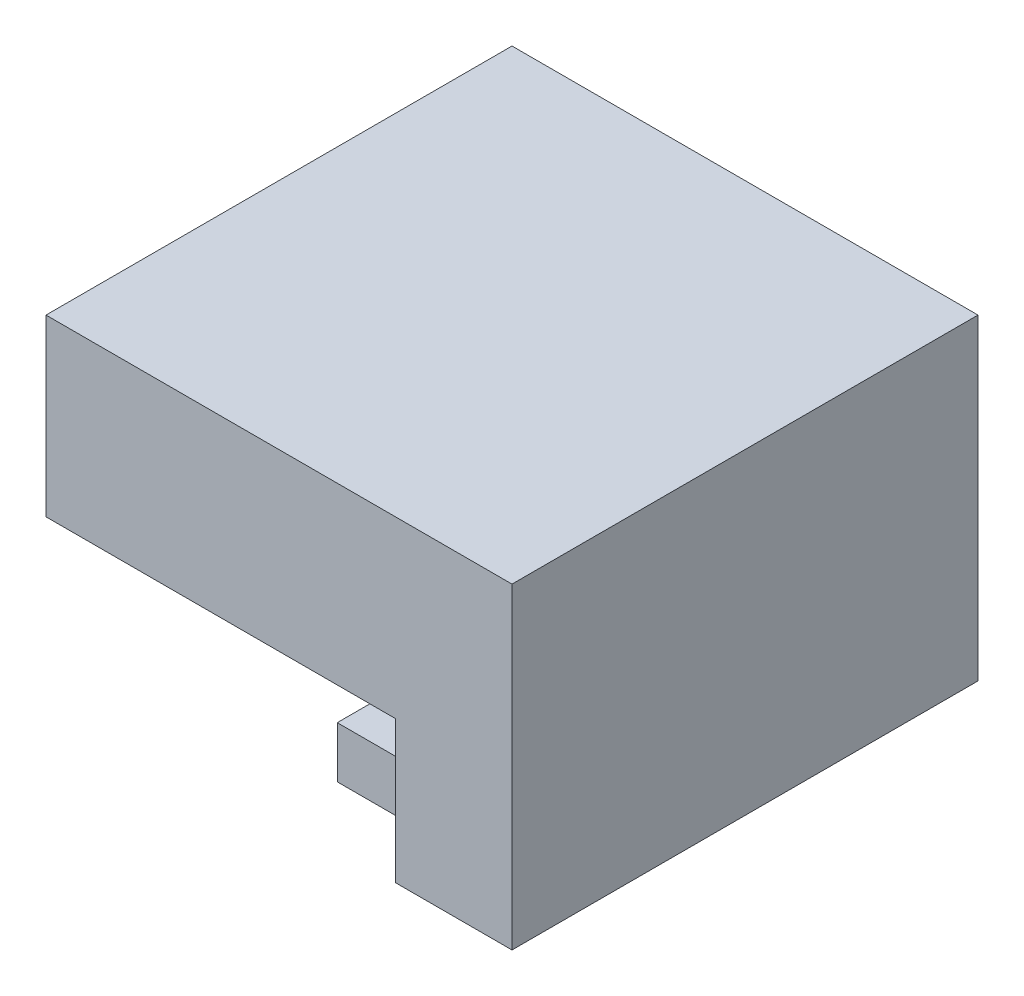
ISO-10303-21;
HEADER;
FILE_DESCRIPTION(('STEP AP214'),'2;1');
FILE_NAME('part.step','',(''),(''),'','','');
FILE_SCHEMA(('AUTOMOTIVE_DESIGN { 1 0 10303 214 1 1 1 1 }'));
ENDSEC;
DATA;
#1=APPLICATION_CONTEXT('core data for automotive mechanical design processes');
#2=APPLICATION_PROTOCOL_DEFINITION('international standard','automotive_design',2000,#1);
#3=PRODUCT_CONTEXT('',#1,'mechanical');
#4=PRODUCT('Part','Part','',(#3));
#5=PRODUCT_RELATED_PRODUCT_CATEGORY('part','',(#4));
#6=PRODUCT_DEFINITION_FORMATION('','',#4);
#7=PRODUCT_DEFINITION_CONTEXT('part definition',#1,'design');
#8=PRODUCT_DEFINITION('design','',#6,#7);
#9=PRODUCT_DEFINITION_SHAPE('','',#8);
#10=(LENGTH_UNIT() NAMED_UNIT(*) SI_UNIT(.MILLI.,.METRE.));
#11=(NAMED_UNIT(*) PLANE_ANGLE_UNIT() SI_UNIT($,.RADIAN.));
#12=(NAMED_UNIT(*) SI_UNIT($,.STERADIAN.) SOLID_ANGLE_UNIT());
#13=UNCERTAINTY_MEASURE_WITH_UNIT(LENGTH_MEASURE(1.E-05),#10,'distance_accuracy_value','');
#14=(GEOMETRIC_REPRESENTATION_CONTEXT(3) GLOBAL_UNCERTAINTY_ASSIGNED_CONTEXT((#13)) GLOBAL_UNIT_ASSIGNED_CONTEXT((#10,
#11,#12)) REPRESENTATION_CONTEXT('',''));
#15=CARTESIAN_POINT('',(0.,0.,0.));
#16=DIRECTION('',(0.,0.,1.));
#17=DIRECTION('',(1.,0.,0.));
#18=AXIS2_PLACEMENT_3D('',#15,#16,#17);
#19=CARTESIAN_POINT('',(19.05,-12.5095,12.7));
#20=DIRECTION('',(1.,0.,0.));
#21=DIRECTION('',(0.,0.,-1.));
#22=AXIS2_PLACEMENT_3D('',#19,#20,#21);
#23=PLANE('',#22);
#24=DIRECTION('',(0.,-1.,0.));
#25=VECTOR('',#24,1.);
#26=CARTESIAN_POINT('',(19.05,-12.5095,-9.525));
#27=LINE('',#26,#25);
#28=CARTESIAN_POINT('',(19.05,-9.7155,-9.525));
#29=VERTEX_POINT('',#28);
#30=CARTESIAN_POINT('',(19.05,-12.5095,-9.525));
#31=VERTEX_POINT('',#30);
#32=EDGE_CURVE('E58',#29,#31,#27,.T.);
#33=ORIENTED_EDGE('',*,*,#32,.F.);
#34=DIRECTION('',(0.,0.,-1.));
#35=VECTOR('',#34,1.);
#36=CARTESIAN_POINT('',(19.05,-9.7155,-9.525));
#37=LINE('',#36,#35);
#38=CARTESIAN_POINT('',(19.05,-9.7155,9.525));
#39=VERTEX_POINT('',#38);
#40=EDGE_CURVE('E147',#39,#29,#37,.T.);
#41=ORIENTED_EDGE('',*,*,#40,.F.);
#42=DIRECTION('',(0.,1.,0.));
#43=VECTOR('',#42,1.);
#44=CARTESIAN_POINT('',(19.05,-12.5095,9.525));
#45=LINE('',#44,#43);
#46=CARTESIAN_POINT('',(19.05,-12.5095,9.525));
#47=VERTEX_POINT('',#46);
#48=EDGE_CURVE('E155',#47,#39,#45,.T.);
#49=ORIENTED_EDGE('',*,*,#48,.F.);
#50=DIRECTION('',(0.,0.,-1.));
#51=VECTOR('',#50,1.);
#52=CARTESIAN_POINT('',(19.05,-12.5095,12.7));
#53=LINE('',#52,#51);
#54=CARTESIAN_POINT('',(19.05,-12.5095,12.7));
#55=VERTEX_POINT('',#54);
#56=EDGE_CURVE('E173',#55,#47,#53,.T.);
#57=ORIENTED_EDGE('',*,*,#56,.F.);
#58=DIRECTION('',(0.,1.,0.));
#59=VECTOR('',#58,1.);
#60=CARTESIAN_POINT('',(19.05,-12.5095,12.7));
#61=LINE('',#60,#59);
#62=CARTESIAN_POINT('',(19.05,-4.7625,12.7));
#63=VERTEX_POINT('',#62);
#64=EDGE_CURVE('E191',#55,#63,#61,.T.);
#65=ORIENTED_EDGE('',*,*,#64,.T.);
#66=DIRECTION('',(0.,0.,-1.));
#67=VECTOR('',#66,1.);
#68=CARTESIAN_POINT('',(19.05,-4.7625,12.7));
#69=LINE('',#68,#67);
#70=CARTESIAN_POINT('',(19.05,-4.7625,-12.7));
#71=VERTEX_POINT('',#70);
#72=EDGE_CURVE('E166',#63,#71,#69,.T.);
#73=ORIENTED_EDGE('',*,*,#72,.T.);
#74=DIRECTION('',(0.,1.,0.));
#75=VECTOR('',#74,1.);
#76=CARTESIAN_POINT('',(19.05,-12.5095,-12.7));
#77=LINE('',#76,#75);
#78=CARTESIAN_POINT('',(19.05,-12.5095,-12.7));
#79=VERTEX_POINT('',#78);
#80=EDGE_CURVE('E179',#79,#71,#77,.T.);
#81=ORIENTED_EDGE('',*,*,#80,.F.);
#82=EDGE_CURVE('E172',#31,#79,#53,.T.);
#83=ORIENTED_EDGE('',*,*,#82,.F.);
#84=EDGE_LOOP('',(#33,#41,#49,#57,#65,#73,#81,#83));
#85=FACE_BOUND('',#84,.T.);
#86=ADVANCED_FACE('F33',(#85),#23,.F.);
#87=CARTESIAN_POINT('',(25.4,-4.7625,-12.7));
#88=DIRECTION('',(0.,1.,0.));
#89=DIRECTION('',(0.,0.,1.));
#90=AXIS2_PLACEMENT_3D('',#87,#88,#89);
#91=PLANE('',#90);
#92=DIRECTION('',(0.,0.,1.));
#93=VECTOR('',#92,1.);
#94=CARTESIAN_POINT('',(6.35,-4.76250000000001,-7.62));
#95=LINE('',#94,#93);
#96=CARTESIAN_POINT('',(6.35,-4.76250000000001,-7.62));
#97=VERTEX_POINT('',#96);
#98=CARTESIAN_POINT('',(6.35,-4.76250000000001,7.62));
#99=VERTEX_POINT('',#98);
#100=EDGE_CURVE('E132',#97,#99,#95,.T.);
#101=ORIENTED_EDGE('',*,*,#100,.F.);
#102=DIRECTION('',(-1.,0.,0.));
#103=VECTOR('',#102,1.);
#104=CARTESIAN_POINT('',(6.35,-4.76250000000001,-7.62));
#105=LINE('',#104,#103);
#106=CARTESIAN_POINT('',(0.,-4.76250000000001,-7.62));
#107=VERTEX_POINT('',#106);
#108=EDGE_CURVE('E123',#97,#107,#105,.T.);
#109=ORIENTED_EDGE('',*,*,#108,.T.);
#110=DIRECTION('',(0.,0.,-1.));
#111=VECTOR('',#110,1.);
#112=CARTESIAN_POINT('',(0.,-4.7625,-12.7));
#113=LINE('',#112,#111);
#114=CARTESIAN_POINT('',(0.,-4.7625,-12.7));
#115=VERTEX_POINT('',#114);
#116=EDGE_CURVE('E199',#107,#115,#113,.T.);
#117=ORIENTED_EDGE('',*,*,#116,.T.);
#118=DIRECTION('',(-1.,0.,0.));
#119=VECTOR('',#118,1.);
#120=CARTESIAN_POINT('',(25.4,-4.7625,-12.7));
#121=LINE('',#120,#119);
#122=EDGE_CURVE('E42',#71,#115,#121,.T.);
#123=ORIENTED_EDGE('',*,*,#122,.F.);
#124=ORIENTED_EDGE('',*,*,#72,.F.);
#125=DIRECTION('',(-1.,0.,0.));
#126=VECTOR('',#125,1.);
#127=CARTESIAN_POINT('',(25.4,-4.7625,12.7));
#128=LINE('',#127,#126);
#129=CARTESIAN_POINT('',(0.,-4.7625,12.7));
#130=VERTEX_POINT('',#129);
#131=EDGE_CURVE('E11',#63,#130,#128,.T.);
#132=ORIENTED_EDGE('',*,*,#131,.T.);
#133=CARTESIAN_POINT('',(0.,-4.7625,7.62));
#134=VERTEX_POINT('',#133);
#135=EDGE_CURVE('E205',#130,#134,#113,.T.);
#136=ORIENTED_EDGE('',*,*,#135,.T.);
#137=DIRECTION('',(-1.,0.,0.));
#138=VECTOR('',#137,1.);
#139=CARTESIAN_POINT('',(6.35,-4.76250000000001,7.62));
#140=LINE('',#139,#138);
#141=EDGE_CURVE('E50',#99,#134,#140,.T.);
#142=ORIENTED_EDGE('',*,*,#141,.F.);
#143=EDGE_LOOP('',(#101,#109,#117,#123,#124,#132,#136,#142));
#144=FACE_BOUND('',#143,.T.);
#145=ADVANCED_FACE('F137',(#144),#91,.F.);
#146=CARTESIAN_POINT('',(25.4,4.7625,12.7));
#147=DIRECTION('',(0.,0.,-1.));
#148=DIRECTION('',(0.,1.,0.));
#149=AXIS2_PLACEMENT_3D('',#146,#147,#148);
#150=PLANE('',#149);
#151=DIRECTION('',(0.,-1.,0.));
#152=VECTOR('',#151,1.);
#153=CARTESIAN_POINT('',(0.,4.7625,12.7));
#154=LINE('',#153,#152);
#155=CARTESIAN_POINT('',(0.,4.7625,12.7));
#156=VERTEX_POINT('',#155);
#157=EDGE_CURVE('E194',#156,#130,#154,.T.);
#158=ORIENTED_EDGE('',*,*,#157,.T.);
#159=ORIENTED_EDGE('',*,*,#131,.F.);
#160=ORIENTED_EDGE('',*,*,#64,.F.);
#161=DIRECTION('',(-1.,0.,0.));
#162=VECTOR('',#161,1.);
#163=CARTESIAN_POINT('',(25.4,-12.5095,12.7));
#164=LINE('',#163,#162);
#165=CARTESIAN_POINT('',(25.4,-12.5095,12.7));
#166=VERTEX_POINT('',#165);
#167=EDGE_CURVE('E170',#166,#55,#164,.T.);
#168=ORIENTED_EDGE('',*,*,#167,.F.);
#169=DIRECTION('',(0.,-1.,0.));
#170=VECTOR('',#169,1.);
#171=CARTESIAN_POINT('',(25.4,4.7625,12.7));
#172=LINE('',#171,#170);
#173=CARTESIAN_POINT('',(25.4,4.7625,12.7));
#174=VERTEX_POINT('',#173);
#175=EDGE_CURVE('E182',#174,#166,#172,.T.);
#176=ORIENTED_EDGE('',*,*,#175,.F.);
#177=DIRECTION('',(-1.,0.,0.));
#178=VECTOR('',#177,1.);
#179=CARTESIAN_POINT('',(25.4,4.7625,12.7));
#180=LINE('',#179,#178);
#181=EDGE_CURVE('E214',#174,#156,#180,.T.);
#182=ORIENTED_EDGE('',*,*,#181,.T.);
#183=EDGE_LOOP('',(#158,#159,#160,#168,#176,#182));
#184=FACE_BOUND('',#183,.T.);
#185=ADVANCED_FACE('F35',(#184),#150,.F.);
#186=CARTESIAN_POINT('',(25.4,4.7625,-12.7));
#187=DIRECTION('',(0.,0.,1.));
#188=DIRECTION('',(0.,-1.,0.));
#189=AXIS2_PLACEMENT_3D('',#186,#187,#188);
#190=PLANE('',#189);
#191=DIRECTION('',(0.,1.,0.));
#192=VECTOR('',#191,1.);
#193=CARTESIAN_POINT('',(0.,4.7625,-12.7));
#194=LINE('',#193,#192);
#195=CARTESIAN_POINT('',(0.,4.7625,-12.7));
#196=VERTEX_POINT('',#195);
#197=EDGE_CURVE('E210',#115,#196,#194,.T.);
#198=ORIENTED_EDGE('',*,*,#197,.T.);
#199=DIRECTION('',(-1.,0.,0.));
#200=VECTOR('',#199,1.);
#201=CARTESIAN_POINT('',(25.4,4.7625,-12.7));
#202=LINE('',#201,#200);
#203=CARTESIAN_POINT('',(25.4,4.7625,-12.7));
#204=VERTEX_POINT('',#203);
#205=EDGE_CURVE('E216',#204,#196,#202,.T.);
#206=ORIENTED_EDGE('',*,*,#205,.F.);
#207=DIRECTION('',(0.,1.,0.));
#208=VECTOR('',#207,1.);
#209=CARTESIAN_POINT('',(25.4,4.7625,-12.7));
#210=LINE('',#209,#208);
#211=CARTESIAN_POINT('',(25.4,-12.5095,-12.7));
#212=VERTEX_POINT('',#211);
#213=EDGE_CURVE('E240',#212,#204,#210,.T.);
#214=ORIENTED_EDGE('',*,*,#213,.F.);
#215=DIRECTION('',(1.,0.,0.));
#216=VECTOR('',#215,1.);
#217=CARTESIAN_POINT('',(25.4,-12.5095,-12.7));
#218=LINE('',#217,#216);
#219=EDGE_CURVE('E176',#79,#212,#218,.T.);
#220=ORIENTED_EDGE('',*,*,#219,.F.);
#221=ORIENTED_EDGE('',*,*,#80,.T.);
#222=ORIENTED_EDGE('',*,*,#122,.T.);
#223=EDGE_LOOP('',(#198,#206,#214,#220,#221,#222));
#224=FACE_BOUND('',#223,.T.);
#225=ADVANCED_FACE('F224',(#224),#190,.F.);
#226=CARTESIAN_POINT('',(25.4,4.7625,-12.7));
#227=DIRECTION('',(0.,-1.,0.));
#228=DIRECTION('',(0.,0.,-1.));
#229=AXIS2_PLACEMENT_3D('',#226,#227,#228);
#230=PLANE('',#229);
#231=DIRECTION('',(0.,0.,1.));
#232=VECTOR('',#231,1.);
#233=CARTESIAN_POINT('',(0.,4.7625,-12.7));
#234=LINE('',#233,#232);
#235=EDGE_CURVE('E212',#196,#156,#234,.T.);
#236=ORIENTED_EDGE('',*,*,#235,.T.);
#237=ORIENTED_EDGE('',*,*,#181,.F.);
#238=DIRECTION('',(0.,0.,1.));
#239=VECTOR('',#238,1.);
#240=CARTESIAN_POINT('',(25.4,4.7625,-12.7));
#241=LINE('',#240,#239);
#242=EDGE_CURVE('E208',#204,#174,#241,.T.);
#243=ORIENTED_EDGE('',*,*,#242,.F.);
#244=ORIENTED_EDGE('',*,*,#205,.T.);
#245=EDGE_LOOP('',(#236,#237,#243,#244));
#246=FACE_BOUND('',#245,.T.);
#247=ADVANCED_FACE('F234',(#246),#230,.F.);
#248=CARTESIAN_POINT('',(25.4,0.,0.));
#249=DIRECTION('',(-1.,0.,0.));
#250=DIRECTION('',(0.,0.,1.));
#251=AXIS2_PLACEMENT_3D('',#248,#249,#250);
#252=PLANE('',#251);
#253=ORIENTED_EDGE('',*,*,#175,.T.);
#254=DIRECTION('',(0.,0.,1.));
#255=VECTOR('',#254,1.);
#256=CARTESIAN_POINT('',(25.4,-12.5095,12.7));
#257=LINE('',#256,#255);
#258=EDGE_CURVE('E167',#212,#166,#257,.T.);
#259=ORIENTED_EDGE('',*,*,#258,.F.);
#260=ORIENTED_EDGE('',*,*,#213,.T.);
#261=ORIENTED_EDGE('',*,*,#242,.T.);
#262=EDGE_LOOP('',(#253,#259,#260,#261));
#263=FACE_BOUND('',#262,.T.);
#264=ADVANCED_FACE('F241',(#263),#252,.F.);
#265=CARTESIAN_POINT('',(0.,0.,0.));
#266=DIRECTION('',(-1.,0.,0.));
#267=DIRECTION('',(0.,0.,1.));
#268=AXIS2_PLACEMENT_3D('',#265,#266,#267);
#269=PLANE('',#268);
#270=CARTESIAN_POINT('',(0.,-4.7625,0.));
#271=DIRECTION('',(-1.,0.,0.));
#272=DIRECTION('',(0.,0.,-1.));
#273=AXIS2_PLACEMENT_3D('',#270,#271,#272);
#274=CIRCLE('',#273,7.62);
#275=EDGE_CURVE('E128',#134,#107,#274,.T.);
#276=ORIENTED_EDGE('',*,*,#275,.F.);
#277=ORIENTED_EDGE('',*,*,#135,.F.);
#278=ORIENTED_EDGE('',*,*,#157,.F.);
#279=ORIENTED_EDGE('',*,*,#235,.F.);
#280=ORIENTED_EDGE('',*,*,#197,.F.);
#281=ORIENTED_EDGE('',*,*,#116,.F.);
#282=EDGE_LOOP('',(#276,#277,#278,#279,#280,#281));
#283=FACE_BOUND('',#282,.T.);
#284=ADVANCED_FACE('F230',(#283),#269,.T.);
#285=CARTESIAN_POINT('',(0.,-12.5095,0.));
#286=DIRECTION('',(0.,1.,0.));
#287=DIRECTION('',(0.,0.,1.));
#288=AXIS2_PLACEMENT_3D('',#285,#286,#287);
#289=PLANE('',#288);
#290=ORIENTED_EDGE('',*,*,#258,.T.);
#291=ORIENTED_EDGE('',*,*,#167,.T.);
#292=ORIENTED_EDGE('',*,*,#56,.T.);
#293=DIRECTION('',(1.,0.,0.));
#294=VECTOR('',#293,1.);
#295=CARTESIAN_POINT('',(12.7,-12.5095,9.525));
#296=LINE('',#295,#294);
#297=CARTESIAN_POINT('',(12.7,-12.5095,9.525));
#298=VERTEX_POINT('',#297);
#299=EDGE_CURVE('E162',#298,#47,#296,.T.);
#300=ORIENTED_EDGE('',*,*,#299,.F.);
#301=DIRECTION('',(0.,0.,1.));
#302=VECTOR('',#301,1.);
#303=CARTESIAN_POINT('',(12.7,-12.5095,-9.525));
#304=LINE('',#303,#302);
#305=CARTESIAN_POINT('',(12.7,-12.5095,-9.525));
#306=VERTEX_POINT('',#305);
#307=EDGE_CURVE('E146',#306,#298,#304,.T.);
#308=ORIENTED_EDGE('',*,*,#307,.F.);
#309=DIRECTION('',(1.,0.,0.));
#310=VECTOR('',#309,1.);
#311=CARTESIAN_POINT('',(12.7,-12.5095,-9.525));
#312=LINE('',#311,#310);
#313=EDGE_CURVE('E164',#306,#31,#312,.T.);
#314=ORIENTED_EDGE('',*,*,#313,.T.);
#315=ORIENTED_EDGE('',*,*,#82,.T.);
#316=ORIENTED_EDGE('',*,*,#219,.T.);
#317=EDGE_LOOP('',(#290,#291,#292,#300,#308,#314,#315,#316));
#318=FACE_BOUND('',#317,.T.);
#319=ADVANCED_FACE('F248',(#318),#289,.F.);
#320=CARTESIAN_POINT('',(12.7,-12.5095,-9.525));
#321=DIRECTION('',(0.,0.,1.));
#322=DIRECTION('',(1.,0.,0.));
#323=AXIS2_PLACEMENT_3D('',#320,#321,#322);
#324=PLANE('',#323);
#325=ORIENTED_EDGE('',*,*,#32,.T.);
#326=ORIENTED_EDGE('',*,*,#313,.F.);
#327=DIRECTION('',(0.,-1.,0.));
#328=VECTOR('',#327,1.);
#329=CARTESIAN_POINT('',(12.7,-12.5095,-9.525));
#330=LINE('',#329,#328);
#331=CARTESIAN_POINT('',(12.7,-9.7155,-9.525));
#332=VERTEX_POINT('',#331);
#333=EDGE_CURVE('E143',#332,#306,#330,.T.);
#334=ORIENTED_EDGE('',*,*,#333,.F.);
#335=DIRECTION('',(1.,0.,0.));
#336=VECTOR('',#335,1.);
#337=CARTESIAN_POINT('',(12.7,-9.7155,-9.525));
#338=LINE('',#337,#336);
#339=EDGE_CURVE('E153',#332,#29,#338,.T.);
#340=ORIENTED_EDGE('',*,*,#339,.T.);
#341=EDGE_LOOP('',(#325,#326,#334,#340));
#342=FACE_BOUND('',#341,.T.);
#343=ADVANCED_FACE('F259',(#342),#324,.F.);
#344=CARTESIAN_POINT('',(12.7,-12.5095,9.525));
#345=DIRECTION('',(0.,0.,-1.));
#346=DIRECTION('',(-1.,0.,0.));
#347=AXIS2_PLACEMENT_3D('',#344,#345,#346);
#348=PLANE('',#347);
#349=ORIENTED_EDGE('',*,*,#48,.T.);
#350=DIRECTION('',(1.,0.,0.));
#351=VECTOR('',#350,1.);
#352=CARTESIAN_POINT('',(12.7,-9.7155,9.525));
#353=LINE('',#352,#351);
#354=CARTESIAN_POINT('',(12.7,-9.7155,9.525));
#355=VERTEX_POINT('',#354);
#356=EDGE_CURVE('E159',#355,#39,#353,.T.);
#357=ORIENTED_EDGE('',*,*,#356,.F.);
#358=DIRECTION('',(0.,1.,0.));
#359=VECTOR('',#358,1.);
#360=CARTESIAN_POINT('',(12.7,-12.5095,9.525));
#361=LINE('',#360,#359);
#362=EDGE_CURVE('E149',#298,#355,#361,.T.);
#363=ORIENTED_EDGE('',*,*,#362,.F.);
#364=ORIENTED_EDGE('',*,*,#299,.T.);
#365=EDGE_LOOP('',(#349,#357,#363,#364));
#366=FACE_BOUND('',#365,.T.);
#367=ADVANCED_FACE('F263',(#366),#348,.F.);
#368=CARTESIAN_POINT('',(12.7,-9.7155,-9.525));
#369=DIRECTION('',(0.,-1.,0.));
#370=DIRECTION('',(0.,0.,-1.));
#371=AXIS2_PLACEMENT_3D('',#368,#369,#370);
#372=PLANE('',#371);
#373=ORIENTED_EDGE('',*,*,#40,.T.);
#374=ORIENTED_EDGE('',*,*,#339,.F.);
#375=DIRECTION('',(0.,0.,-1.));
#376=VECTOR('',#375,1.);
#377=CARTESIAN_POINT('',(12.7,-9.7155,-9.525));
#378=LINE('',#377,#376);
#379=EDGE_CURVE('E151',#355,#332,#378,.T.);
#380=ORIENTED_EDGE('',*,*,#379,.F.);
#381=ORIENTED_EDGE('',*,*,#356,.T.);
#382=EDGE_LOOP('',(#373,#374,#380,#381));
#383=FACE_BOUND('',#382,.T.);
#384=ADVANCED_FACE('F266',(#383),#372,.F.);
#385=CARTESIAN_POINT('',(12.7,0.,0.));
#386=DIRECTION('',(1.,0.,0.));
#387=DIRECTION('',(0.,0.,-1.));
#388=AXIS2_PLACEMENT_3D('',#385,#386,#387);
#389=PLANE('',#388);
#390=ORIENTED_EDGE('',*,*,#333,.T.);
#391=ORIENTED_EDGE('',*,*,#307,.T.);
#392=ORIENTED_EDGE('',*,*,#362,.T.);
#393=ORIENTED_EDGE('',*,*,#379,.T.);
#394=EDGE_LOOP('',(#390,#391,#392,#393));
#395=FACE_BOUND('',#394,.T.);
#396=ADVANCED_FACE('F270',(#395),#389,.F.);
#397=CARTESIAN_POINT('',(6.35,-4.7625,0.));
#398=DIRECTION('',(-1.,0.,0.));
#399=DIRECTION('',(0.,0.,1.));
#400=AXIS2_PLACEMENT_3D('',#397,#398,#399);
#401=CYLINDRICAL_SURFACE('',#400,7.62);
#402=ORIENTED_EDGE('',*,*,#275,.T.);
#403=ORIENTED_EDGE('',*,*,#108,.F.);
#404=CARTESIAN_POINT('',(6.35,-4.7625,0.));
#405=DIRECTION('',(-1.,0.,0.));
#406=DIRECTION('',(0.,0.,-1.));
#407=AXIS2_PLACEMENT_3D('',#404,#405,#406);
#408=CIRCLE('',#407,7.62);
#409=EDGE_CURVE('E126',#99,#97,#408,.T.);
#410=ORIENTED_EDGE('',*,*,#409,.F.);
#411=ORIENTED_EDGE('',*,*,#141,.T.);
#412=EDGE_LOOP('',(#402,#403,#410,#411));
#413=FACE_BOUND('',#412,.T.);
#414=ADVANCED_FACE('F125',(#413),#401,.F.);
#415=CARTESIAN_POINT('',(6.35,-4.7625,0.));
#416=DIRECTION('',(1.,0.,0.));
#417=DIRECTION('',(0.,0.,-1.));
#418=AXIS2_PLACEMENT_3D('',#415,#416,#417);
#419=PLANE('',#418);
#420=ORIENTED_EDGE('',*,*,#409,.T.);
#421=ORIENTED_EDGE('',*,*,#100,.T.);
#422=EDGE_LOOP('',(#420,#421));
#423=FACE_BOUND('',#422,.T.);
#424=ADVANCED_FACE('F135',(#423),#419,.F.);
#425=CLOSED_SHELL('',(#86,#145,#185,#225,#247,#264,#284,#319,#343,#367,#384,#396,#414,#424));
#426=MANIFOLD_SOLID_BREP('B2',#425);
#427=ADVANCED_BREP_SHAPE_REPRESENTATION('',(#18,#426),#14);
#428=SHAPE_DEFINITION_REPRESENTATION(#9,#427);
ENDSEC;
END-ISO-10303-21;
